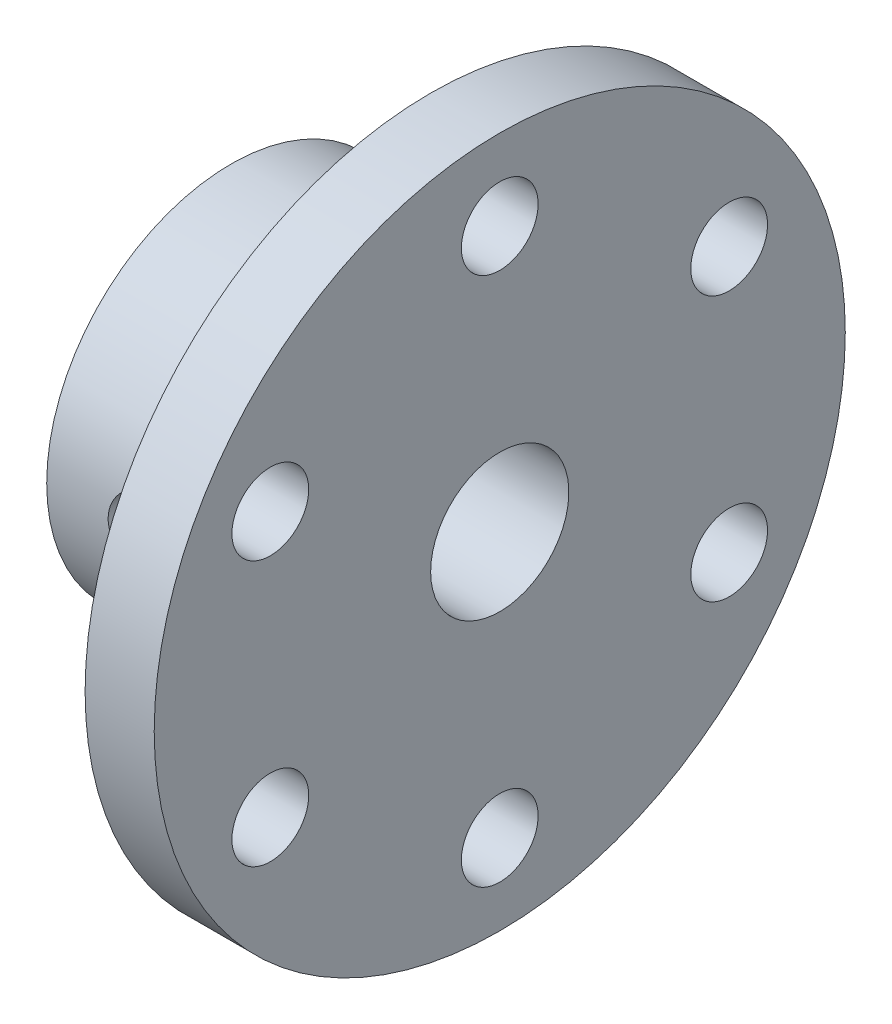
ISO-10303-21;
HEADER;
FILE_DESCRIPTION(('STEP AP214'),'2;1');
FILE_NAME('part.step','',(''),(''),'','','');
FILE_SCHEMA(('AUTOMOTIVE_DESIGN { 1 0 10303 214 1 1 1 1 }'));
ENDSEC;
DATA;
#1=APPLICATION_CONTEXT('core data for automotive mechanical design processes');
#2=APPLICATION_PROTOCOL_DEFINITION('international standard','automotive_design',2000,#1);
#3=PRODUCT_CONTEXT('',#1,'mechanical');
#4=PRODUCT('Part','Part','',(#3));
#5=PRODUCT_RELATED_PRODUCT_CATEGORY('part','',(#4));
#6=PRODUCT_DEFINITION_FORMATION('','',#4);
#7=PRODUCT_DEFINITION_CONTEXT('part definition',#1,'design');
#8=PRODUCT_DEFINITION('design','',#6,#7);
#9=PRODUCT_DEFINITION_SHAPE('','',#8);
#10=(LENGTH_UNIT() NAMED_UNIT(*) SI_UNIT(.MILLI.,.METRE.));
#11=(NAMED_UNIT(*) PLANE_ANGLE_UNIT() SI_UNIT($,.RADIAN.));
#12=(NAMED_UNIT(*) SI_UNIT($,.STERADIAN.) SOLID_ANGLE_UNIT());
#13=UNCERTAINTY_MEASURE_WITH_UNIT(LENGTH_MEASURE(1.E-05),#10,'distance_accuracy_value','');
#14=(GEOMETRIC_REPRESENTATION_CONTEXT(3) GLOBAL_UNCERTAINTY_ASSIGNED_CONTEXT((#13)) GLOBAL_UNIT_ASSIGNED_CONTEXT((#10,
#11,#12)) REPRESENTATION_CONTEXT('',''));
#15=CARTESIAN_POINT('',(0.,0.,0.));
#16=DIRECTION('',(0.,0.,1.));
#17=DIRECTION('',(1.,0.,0.));
#18=AXIS2_PLACEMENT_3D('',#15,#16,#17);
#19=CARTESIAN_POINT('',(-11.6129032258065,0.,0.));
#20=DIRECTION('',(-1.,0.,0.));
#21=DIRECTION('',(0.,0.,1.));
#22=AXIS2_PLACEMENT_3D('',#19,#20,#21);
#23=CYLINDRICAL_SURFACE('',#22,12.);
#24=CARTESIAN_POINT('',(-5.7004608294931,0.,12.));
#25=CARTESIAN_POINT('',(-5.70046578443154,-0.138818083403321,11.999997430533));
#26=CARTESIAN_POINT('',(-5.71206216093059,-0.277697579041751,11.9975665755009));
#27=CARTESIAN_POINT('',(-5.7580995285588,-0.551522632533987,11.9881040198136));
#28=CARTESIAN_POINT('',(-5.79255787556696,-0.686465120256625,11.981068823785));
#29=CARTESIAN_POINT('',(-5.88320173933673,-0.948418264582684,11.963182183924));
#30=CARTESIAN_POINT('',(-5.93936562149087,-1.07543667341837,11.9523345410529));
#31=CARTESIAN_POINT('',(-6.07176004720546,-1.31824065721192,11.9279985561972));
#32=CARTESIAN_POINT('',(-6.14798969180476,-1.43402673506865,11.9145103325195));
#33=CARTESIAN_POINT('',(-6.31953350987439,-1.65278064861767,11.886154000493));
#34=CARTESIAN_POINT('',(-6.41508483196326,-1.75556048832537,11.8712701169706));
#35=CARTESIAN_POINT('',(-6.62205014788332,-1.94375555353879,11.841913153849));
#36=CARTESIAN_POINT('',(-6.73346545323763,-2.02916934192198,11.8274401083337));
#37=CARTESIAN_POINT('',(-6.97036476702542,-2.18102063354433,11.8003888519062));
#38=CARTESIAN_POINT('',(-7.09597759849858,-2.24726109361302,11.7878309034966));
#39=CARTESIAN_POINT('',(-7.35685573303861,-2.35762238696127,11.7662568130004));
#40=CARTESIAN_POINT('',(-7.49211999437817,-2.40174560335282,11.7572402893514));
#41=CARTESIAN_POINT('',(-7.76643130432438,-2.46600480267474,11.7439300197224));
#42=CARTESIAN_POINT('',(-7.90539754816263,-2.48647195393597,11.7395711371173));
#43=CARTESIAN_POINT('',(-8.18485451521836,-2.50386715311229,11.7358738143298));
#44=CARTESIAN_POINT('',(-8.32534506722369,-2.50079781789373,11.7365348160196));
#45=CARTESIAN_POINT('',(-8.60142288544345,-2.47147438074394,11.7427434863835));
#46=CARTESIAN_POINT('',(-8.73705278881553,-2.4456021046544,11.748210673598));
#47=CARTESIAN_POINT('',(-9.00200384878296,-2.3720108705989,11.7632887523188));
#48=CARTESIAN_POINT('',(-9.13132468070576,-2.32429078962763,11.7728998568263));
#49=CARTESIAN_POINT('',(-9.38107528632506,-2.20800006427856,11.795263829282));
#50=CARTESIAN_POINT('',(-9.50143342254725,-2.13928005068473,11.8080390757117));
#51=CARTESIAN_POINT('',(-9.72905231802942,-1.98304539854963,11.8352778002144));
#52=CARTESIAN_POINT('',(-9.83631144716505,-1.89552842452517,11.8497414879707));
#53=CARTESIAN_POINT('',(-10.0368887516538,-1.70214984309356,11.8790746185982));
#54=CARTESIAN_POINT('',(-10.1298931672871,-1.59596286682416,11.8939464639895));
#55=CARTESIAN_POINT('',(-10.296821713951,-1.36933457722359,11.92216176286));
#56=CARTESIAN_POINT('',(-10.3707455586899,-1.24889305005153,11.9355051934047));
#57=CARTESIAN_POINT('',(-10.497480992565,-0.996811082470951,11.9591974188563));
#58=CARTESIAN_POINT('',(-10.5502544386273,-0.865150923852994,11.9695407942052));
#59=CARTESIAN_POINT('',(-10.6328442391641,-0.594569241944303,11.9860267642256));
#60=CARTESIAN_POINT('',(-10.6626636159559,-0.455648677190172,11.9921699119211));
#61=CARTESIAN_POINT('',(-10.6980493336289,-0.177183731401664,11.9994855043091));
#62=CARTESIAN_POINT('',(-10.7040447124816,-0.0376961110523507,12.0007458707516));
#63=CARTESIAN_POINT('',(-10.6927709295549,0.240287597515435,11.9983990450555));
#64=CARTESIAN_POINT('',(-10.6755031922899,0.378783745924522,11.9947921509631));
#65=CARTESIAN_POINT('',(-10.618549522554,0.649452734239632,11.9831712995837));
#66=CARTESIAN_POINT('',(-10.5790858587262,0.781674385788418,11.9752010573615));
#67=CARTESIAN_POINT('',(-10.4791051086503,1.03762289332267,11.9557445448479));
#68=CARTESIAN_POINT('',(-10.4185863477611,1.16134907267356,11.9442579948916));
#69=CARTESIAN_POINT('',(-10.277300073018,1.39858861388699,11.9188248298143));
#70=CARTESIAN_POINT('',(-10.196276970355,1.51194643893967,11.9048478762466));
#71=CARTESIAN_POINT('',(-10.0166217033406,1.72361089177305,11.8760513659942));
#72=CARTESIAN_POINT('',(-9.91798747845521,1.82191575582658,11.8612317108502));
#73=CARTESIAN_POINT('',(-9.70394967549369,2.00235729730361,11.8321204906275));
#74=CARTESIAN_POINT('',(-9.58829476558253,2.08419829200409,11.81784178615));
#75=CARTESIAN_POINT('',(-9.34462826106552,2.22729438158487,11.7917120203161));
#76=CARTESIAN_POINT('',(-9.21661718121488,2.28855033355729,11.779860857893));
#77=CARTESIAN_POINT('',(-8.95253843689663,2.38834492887845,11.7600340141608));
#78=CARTESIAN_POINT('',(-8.81651875516142,2.42700619656064,11.7520374556937));
#79=CARTESIAN_POINT('',(-8.53972772850857,2.48088077046815,11.7407836941939));
#80=CARTESIAN_POINT('',(-8.39895706625421,2.49609743088882,11.7375258132073));
#81=CARTESIAN_POINT('',(-8.1196340274938,2.50251852975223,11.7361581461701));
#82=CARTESIAN_POINT('',(-7.98109268904898,2.49419085245451,11.73794804643));
#83=CARTESIAN_POINT('',(-7.70743281165265,2.45479810628064,11.7462489450985));
#84=CARTESIAN_POINT('',(-7.57231423986088,2.42373325564533,11.7527598981925));
#85=CARTESIAN_POINT('',(-7.30966528571177,2.3399643553717,11.7697226489543));
#86=CARTESIAN_POINT('',(-7.18211433651924,2.28732235136843,11.7801631401586));
#87=CARTESIAN_POINT('',(-6.93758327743976,2.16194914599515,11.8038141147748));
#88=CARTESIAN_POINT('',(-6.82060415022684,2.0892160796606,11.8170248553092));
#89=CARTESIAN_POINT('',(-6.5982175753342,1.92414739068482,11.8450315910229));
#90=CARTESIAN_POINT('',(-6.49306258036312,1.83147578083645,11.8598522773681));
#91=CARTESIAN_POINT('',(-6.29964184304038,1.62984887623067,11.8892367916643));
#92=CARTESIAN_POINT('',(-6.21137999439012,1.52088983766594,11.9038005596976));
#93=CARTESIAN_POINT('',(-6.05328368312497,1.28826885501541,11.9312288909527));
#94=CARTESIAN_POINT('',(-5.98367346972052,1.1644518430427,11.9440719214649));
#95=CARTESIAN_POINT('',(-5.86636037263305,0.906639687996908,11.9663981698818));
#96=CARTESIAN_POINT('',(-5.81863833512934,0.772653563814488,11.975884323642));
#97=CARTESIAN_POINT('',(-5.75538027291624,0.532030585800211,11.9886499956289));
#98=CARTESIAN_POINT('',(-5.73482330307538,0.426735187455858,11.9928807132279));
#99=CARTESIAN_POINT('',(-5.70736192093843,0.214305348353073,11.9985566557952));
#100=CARTESIAN_POINT('',(-5.70045700415871,0.107170975697743,12.0000019836917));
#101=CARTESIAN_POINT('',(-5.7004608294931,0.,12.));
#102=B_SPLINE_CURVE_WITH_KNOTS('',3,(#24,#25,#26,#27,#28,#29,#30,#31,#32,#33,#34,#35,#36,#37,
#38,#39,#40,#41,#42,#43,#44,#45,#46,#47,#48,#49,#50,#51,#52,#53,#54,#55,#56,#57,#58,#59,#60,#61,
#62,#63,#64,#65,#66,#67,#68,#69,#70,#71,#72,#73,#74,#75,#76,#77,#78,#79,#80,#81,#82,#83,#84,#85,
#86,#87,#88,#89,#90,#91,#92,#93,#94,#95,#96,#97,#98,#99,#100,#101),.UNSPECIFIED.,.T.,.F.,(4,2,2,
2,2,2,2,2,2,2,2,2,2,2,2,2,2,2,2,2,2,2,2,2,2,2,2,2,2,2,2,2,2,2,2,2,2,2,4),(0.,0.416062090206367,
0.83244039981245,1.24840475765089,1.66435048314598,2.08575052776245,2.50718543103572,
2.93280898357097,3.35838666570981,3.77793150339709,4.19742969534329,4.61003424258119,
5.0226600006056,5.43829184833498,5.85397536736069,6.27779052710932,6.70161204556436,
7.12619448999325,7.55072102091543,7.96756678815351,8.38438703104555,8.79710573265243,
9.20985726781867,9.62803167991474,10.0462550512915,10.4714252765867,10.8965777970262,
11.3194010019005,11.7421637082837,12.1565844658208,12.5710012456272,12.9842346278651,
13.3975063816296,13.8183804966062,14.2393515023474,14.6651772879651,15.0906297292995,
15.4118517695456,15.7330619394678),.UNSPECIFIED.);
#103=CARTESIAN_POINT('',(-5.7004608294931,0.,12.));
#104=VERTEX_POINT('',#103);
#105=EDGE_CURVE('E93',#104,#104,#102,.T.);
#106=ORIENTED_EDGE('',*,*,#105,.T.);
#107=EDGE_LOOP('',(#106));
#108=FACE_BOUND('',#107,.T.);
#109=CARTESIAN_POINT('',(-14.7004608294931,0.,0.));
#110=DIRECTION('',(-1.,0.,0.));
#111=DIRECTION('',(0.,0.,1.));
#112=AXIS2_PLACEMENT_3D('',#109,#110,#111);
#113=CIRCLE('',#112,12.);
#114=CARTESIAN_POINT('',(-14.7004608294931,0.,12.));
#115=VERTEX_POINT('',#114);
#116=EDGE_CURVE('E10',#115,#115,#113,.T.);
#117=ORIENTED_EDGE('',*,*,#116,.F.);
#118=EDGE_LOOP('',(#117));
#119=FACE_BOUND('',#118,.T.);
#120=CARTESIAN_POINT('',(-1.70046082949309,0.,0.));
#121=DIRECTION('',(-1.,0.,0.));
#122=DIRECTION('',(0.,0.,1.));
#123=AXIS2_PLACEMENT_3D('',#120,#121,#122);
#124=CIRCLE('',#123,12.);
#125=CARTESIAN_POINT('',(-1.70046082949309,0.,12.));
#126=VERTEX_POINT('',#125);
#127=EDGE_CURVE('E58',#126,#126,#124,.T.);
#128=ORIENTED_EDGE('',*,*,#127,.T.);
#129=EDGE_LOOP('',(#128));
#130=FACE_BOUND('',#129,.T.);
#131=ADVANCED_FACE('F35',(#108,#119,#130),#23,.T.);
#132=CARTESIAN_POINT('',(-14.7004608294931,4.5,0.));
#133=DIRECTION('',(1.,0.,0.));
#134=DIRECTION('',(0.,0.,-1.));
#135=AXIS2_PLACEMENT_3D('',#132,#133,#134);
#136=PLANE('',#135);
#137=CARTESIAN_POINT('',(-14.7004608294931,0.,0.));
#138=DIRECTION('',(-1.,0.,0.));
#139=DIRECTION('',(0.,0.,1.));
#140=AXIS2_PLACEMENT_3D('',#137,#138,#139);
#141=CIRCLE('',#140,4.5);
#142=CARTESIAN_POINT('',(-14.7004608294931,0.,4.5));
#143=VERTEX_POINT('',#142);
#144=EDGE_CURVE('E42',#143,#143,#141,.T.);
#145=ORIENTED_EDGE('',*,*,#144,.F.);
#146=EDGE_LOOP('',(#145));
#147=FACE_BOUND('',#146,.T.);
#148=ORIENTED_EDGE('',*,*,#116,.T.);
#149=EDGE_LOOP('',(#148));
#150=FACE_BOUND('',#149,.T.);
#151=ADVANCED_FACE('F154',(#147,#150),#136,.F.);
#152=CARTESIAN_POINT('',(-11.6129032258065,0.,0.));
#153=DIRECTION('',(-1.,0.,0.));
#154=DIRECTION('',(0.,0.,1.));
#155=AXIS2_PLACEMENT_3D('',#152,#153,#154);
#156=CYLINDRICAL_SURFACE('',#155,4.5);
#157=CARTESIAN_POINT('',(-5.7004608294931,0.,4.5));
#158=CARTESIAN_POINT('',(-5.7004571643019,-0.129758090207667,4.50000314465333));
#159=CARTESIAN_POINT('',(-5.71060739985001,-0.259495048046451,4.49433969900333));
#160=CARTESIAN_POINT('',(-5.75065269096491,-0.514936094239148,4.4722793076248));
#161=CARTESIAN_POINT('',(-5.78055141084955,-0.640639429617415,4.45588036993802));
#162=CARTESIAN_POINT('',(-5.85852098655835,-0.884087336941564,4.41402427059755));
#163=CARTESIAN_POINT('',(-5.90652508361543,-1.0018592959983,4.3886004059786));
#164=CARTESIAN_POINT('',(-6.01889249835716,-1.2274597175802,4.33092577070178));
#165=CARTESIAN_POINT('',(-6.08325974687836,-1.33528578235963,4.29867335996867));
#166=CARTESIAN_POINT('',(-6.23154751199603,-1.54633615143593,4.22753981437698));
#167=CARTESIAN_POINT('',(-6.3165164772319,-1.64871905556101,4.18835368821003));
#168=CARTESIAN_POINT('',(-6.50129349685984,-1.83858802759269,4.10855473455516));
#169=CARTESIAN_POINT('',(-6.6011165142759,-1.9260588811793,4.06794050035681));
#170=CARTESIAN_POINT('',(-6.82477603972435,-2.09257063902238,3.98505246395041));
#171=CARTESIAN_POINT('',(-6.95002093070017,-2.1698588213463,3.94302761192724));
#172=CARTESIAN_POINT('',(-7.21415222076762,-2.30193682615168,3.86741690619417));
#173=CARTESIAN_POINT('',(-7.35301873387804,-2.35675885816851,3.83381899786442));
#174=CARTESIAN_POINT('',(-7.61051805244073,-2.43228219832065,3.78623301761536));
#175=CARTESIAN_POINT('',(-7.72727050808539,-2.45773278234939,3.76960776715246));
#176=CARTESIAN_POINT('',(-7.96419646860895,-2.49167870940791,3.74726165075166));
#177=CARTESIAN_POINT('',(-8.08436648246517,-2.50019076575653,3.74153003626678));
#178=CARTESIAN_POINT('',(-8.32479192466561,-2.49980245234747,3.74178926850116));
#179=CARTESIAN_POINT('',(-8.44504730255001,-2.49088301540577,3.74779295170549));
#180=CARTESIAN_POINT('',(-8.68203876789353,-2.45610447914475,3.77067196518534));
#181=CARTESIAN_POINT('',(-8.79877251526869,-2.43023436481244,3.78755436462961));
#182=CARTESIAN_POINT('',(-9.02589307748626,-2.36277650709342,3.82999424192159));
#183=CARTESIAN_POINT('',(-9.13627847491985,-2.32118526919617,3.85555364837623));
#184=CARTESIAN_POINT('',(-9.34886835334788,-2.2237025684374,3.91258606121716));
#185=CARTESIAN_POINT('',(-9.45106961856553,-2.16780552026577,3.9440613760294));
#186=CARTESIAN_POINT('',(-9.66087412483231,-2.03346434937434,4.01517496523541));
#187=CARTESIAN_POINT('',(-9.76693808291042,-1.95288470610688,4.05532685168251));
#188=CARTESIAN_POINT('',(-9.96499778212611,-1.77596825202837,4.13586693478143));
#189=CARTESIAN_POINT('',(-10.0569823092537,-1.67961900609976,4.17625529347124));
#190=CARTESIAN_POINT('',(-10.2336097797988,-1.46213900169329,4.25757409114108));
#191=CARTESIAN_POINT('',(-10.3165630216147,-1.33948616107143,4.29814437745206));
#192=CARTESIAN_POINT('',(-10.4602713782368,-1.07947802612398,4.37068555059183));
#193=CARTESIAN_POINT('',(-10.5210411051095,-0.942132487120818,4.40266209436034));
#194=CARTESIAN_POINT('',(-10.6139716653457,-0.666748026155545,4.45237093488905));
#195=CARTESIAN_POINT('',(-10.6478555988839,-0.529448884330643,4.4709525095323));
#196=CARTESIAN_POINT('',(-10.6919345347374,-0.250024186967271,4.49522961224014));
#197=CARTESIAN_POINT('',(-10.7021504594838,-0.107903006965403,4.50093652134351));
#198=CARTESIAN_POINT('',(-10.6985276106459,0.159736992061356,4.49892791417126));
#199=CARTESIAN_POINT('',(-10.6872840810337,0.285311755713903,4.49266045059943));
#200=CARTESIAN_POINT('',(-10.6463089721832,0.532461389342114,4.47010960580979));
#201=CARTESIAN_POINT('',(-10.6165767921589,0.65403612920241,4.45382589911582));
#202=CARTESIAN_POINT('',(-10.5400895191064,0.889626042147506,4.41280294973003));
#203=CARTESIAN_POINT('',(-10.4933971810545,1.00366727511817,4.38809489870752));
#204=CARTESIAN_POINT('',(-10.3846346471433,1.22242448859806,4.33225575192423));
#205=CARTESIAN_POINT('',(-10.3225603361765,1.32713796346353,4.30112293773311));
#206=CARTESIAN_POINT('',(-10.1775486376563,1.53587082102379,4.23136184219272));
#207=CARTESIAN_POINT('',(-10.0931200773049,1.63870553707675,4.19229170580865));
#208=CARTESIAN_POINT('',(-9.90936775627641,1.82953913965853,4.1126031721819));
#209=CARTESIAN_POINT('',(-9.81002762706539,1.91752149430534,4.07198311058146));
#210=CARTESIAN_POINT('',(-9.58739918187839,2.08511961470323,3.98896862337331));
#211=CARTESIAN_POINT('',(-9.46270656196853,2.16300015680814,3.94680755532472));
#212=CARTESIAN_POINT('',(-9.19961617111344,2.2963793260761,3.87073262793339));
#213=CARTESIAN_POINT('',(-9.06123813251521,2.3519096094174,3.83680713123626));
#214=CARTESIAN_POINT('',(-8.80424385938245,2.42888889767731,3.78841904471707));
#215=CARTESIAN_POINT('',(-8.68751955715707,2.45502886139893,3.77137372433235));
#216=CARTESIAN_POINT('',(-8.45051419214992,2.49033925721538,3.74815645586868));
#217=CARTESIAN_POINT('',(-8.33023680445226,2.49952663983992,3.74197364688922));
#218=CARTESIAN_POINT('',(-8.08943907236195,2.50043819091779,3.74136462499467));
#219=CARTESIAN_POINT('',(-7.96891861187079,2.49214061904494,3.74695304811208));
#220=CARTESIAN_POINT('',(-7.73129284422345,2.45851643173268,3.7690960964836));
#221=CARTESIAN_POINT('',(-7.61418976772197,2.4331789421246,3.78565772428186));
#222=CARTESIAN_POINT('',(-7.38664196407322,2.36679483205659,3.82750534381749));
#223=CARTESIAN_POINT('',(-7.2761782761429,2.32579567267027,3.85276495463757));
#224=CARTESIAN_POINT('',(-7.06335254597256,2.22949442021241,3.90927937487658));
#225=CARTESIAN_POINT('',(-6.96099364447256,2.17418681746633,3.94053649252252));
#226=CARTESIAN_POINT('',(-6.75089853691695,2.04119262548492,4.01123588994594));
#227=CARTESIAN_POINT('',(-6.64467641649667,1.96138962505478,4.05120181770525));
#228=CARTESIAN_POINT('',(-6.44616571145814,1.7860593103316,4.13150106760693));
#229=CARTESIAN_POINT('',(-6.35388849898611,1.6905192936934,4.17183466146657));
#230=CARTESIAN_POINT('',(-6.17624818162492,1.47447866246712,4.25330121765014));
#231=CARTESIAN_POINT('',(-6.09260518370709,1.35241492924804,4.29408020269288));
#232=CARTESIAN_POINT('',(-5.94740576468531,1.09349141366307,4.36718657718672));
#233=CARTESIAN_POINT('',(-5.88583323030352,0.956642521083981,4.3995201278104));
#234=CARTESIAN_POINT('',(-5.79218939148772,0.684823227607052,4.44953408218067));
#235=CARTESIAN_POINT('',(-5.75795818135547,0.550796610514851,4.46827306143731));
#236=CARTESIAN_POINT('',(-5.71210471808862,0.277835968952621,4.49349953832038));
#237=CARTESIAN_POINT('',(-5.70046475307577,0.138905875971108,4.49999663365248));
#238=CARTESIAN_POINT('',(-5.7004608294931,0.,4.5));
#239=B_SPLINE_CURVE_WITH_KNOTS('',3,(#157,#158,#159,#160,#161,#162,#163,#164,#165,#166,#167,
#168,#169,#170,#171,#172,#173,#174,#175,#176,#177,#178,#179,#180,#181,#182,#183,#184,#185,#186,
#187,#188,#189,#190,#191,#192,#193,#194,#195,#196,#197,#198,#199,#200,#201,#202,#203,#204,#205,
#206,#207,#208,#209,#210,#211,#212,#213,#214,#215,#216,#217,#218,#219,#220,#221,#222,#223,#224,
#225,#226,#227,#228,#229,#230,#231,#232,#233,#234,#235,#236,#237,#238),.UNSPECIFIED.,.T.,.F.,(4,
2,2,2,2,2,2,2,2,2,2,2,2,2,2,2,2,2,2,2,2,2,2,2,2,2,2,2,2,2,2,2,2,2,2,2,2,2,2,2,4),(0.,
0.388735550907335,0.777543251702007,1.16493112478047,1.55241214615887,1.96683794951781,
2.38168408101693,2.83857267136893,3.29480391312177,3.6551617664921,4.01516387654727,
4.37555999005166,4.73619053136807,5.09690128126581,5.45775307616217,5.87344204444458,
6.2894603975851,6.74765475008831,7.20554674747981,7.63096944961687,8.05601593594985,
8.43288535066555,8.80976701233836,9.18526813217113,9.56086981770374,9.97519675058502,
10.389981864785,10.846544170616,11.3024575214123,11.6633530399673,12.0238875107277,
12.3848705249248,12.7460841223787,13.1062116731933,13.466478103307,13.8810342040651,
14.2959265740115,14.7540149206222,15.2117681400763,15.6282357181934,16.0443766473137),.UNSPECIFIED.);
#240=CARTESIAN_POINT('',(-5.7004608294931,0.,4.5));
#241=VERTEX_POINT('',#240);
#242=EDGE_CURVE('E104',#241,#241,#239,.T.);
#243=ORIENTED_EDGE('',*,*,#242,.F.);
#244=EDGE_LOOP('',(#243));
#245=FACE_BOUND('',#244,.T.);
#246=CARTESIAN_POINT('',(2.79953917050691,0.,0.));
#247=DIRECTION('',(-1.,0.,0.));
#248=DIRECTION('',(0.,0.,1.));
#249=AXIS2_PLACEMENT_3D('',#246,#247,#248);
#250=CIRCLE('',#249,4.5);
#251=CARTESIAN_POINT('',(2.79953917050691,0.,4.5));
#252=VERTEX_POINT('',#251);
#253=EDGE_CURVE('E46',#252,#252,#250,.T.);
#254=ORIENTED_EDGE('',*,*,#253,.F.);
#255=EDGE_LOOP('',(#254));
#256=FACE_BOUND('',#255,.T.);
#257=ORIENTED_EDGE('',*,*,#144,.T.);
#258=EDGE_LOOP('',(#257));
#259=FACE_BOUND('',#258,.T.);
#260=ADVANCED_FACE('F151',(#245,#256,#259),#156,.F.);
#261=CARTESIAN_POINT('',(2.79953917050691,22.5,0.));
#262=DIRECTION('',(-1.,0.,0.));
#263=DIRECTION('',(0.,0.,1.));
#264=AXIS2_PLACEMENT_3D('',#261,#262,#263);
#265=PLANE('',#264);
#266=CARTESIAN_POINT('',(2.79953917050691,17.25,0.));
#267=DIRECTION('',(-1.,0.,0.));
#268=DIRECTION('',(0.,0.,1.));
#269=AXIS2_PLACEMENT_3D('',#266,#267,#268);
#270=CIRCLE('',#269,2.5);
#271=CARTESIAN_POINT('',(2.79953917050691,17.25,2.5));
#272=VERTEX_POINT('',#271);
#273=EDGE_CURVE('E61',#272,#272,#270,.F.);
#274=ORIENTED_EDGE('',*,*,#273,.F.);
#275=EDGE_LOOP('',(#274));
#276=FACE_BOUND('',#275,.T.);
#277=CARTESIAN_POINT('',(2.79953917050691,8.62499999999914,-14.9389382152811));
#278=DIRECTION('',(-1.,0.,0.));
#279=DIRECTION('',(0.,0.,1.));
#280=AXIS2_PLACEMENT_3D('',#277,#278,#279);
#281=CIRCLE('',#280,2.50000000000092);
#282=CARTESIAN_POINT('',(2.79953917050691,8.62499999999914,-12.4389382152802));
#283=VERTEX_POINT('',#282);
#284=EDGE_CURVE('E69',#283,#283,#281,.F.);
#285=ORIENTED_EDGE('',*,*,#284,.F.);
#286=EDGE_LOOP('',(#285));
#287=FACE_BOUND('',#286,.T.);
#288=CARTESIAN_POINT('',(2.79953917050691,-8.62500000000085,-14.9389382152801));
#289=DIRECTION('',(-1.,0.,0.));
#290=DIRECTION('',(0.,0.,1.));
#291=AXIS2_PLACEMENT_3D('',#288,#289,#290);
#292=CIRCLE('',#291,2.50000000000181);
#293=CARTESIAN_POINT('',(2.79953917050691,-8.62500000000085,-12.4389382152783));
#294=VERTEX_POINT('',#293);
#295=EDGE_CURVE('E62',#294,#294,#292,.F.);
#296=ORIENTED_EDGE('',*,*,#295,.F.);
#297=EDGE_LOOP('',(#296));
#298=FACE_BOUND('',#297,.T.);
#299=CARTESIAN_POINT('',(2.79953917050691,-17.25,1.95687291924082E-12));
#300=DIRECTION('',(-1.,0.,0.));
#301=DIRECTION('',(0.,0.,1.));
#302=AXIS2_PLACEMENT_3D('',#299,#300,#301);
#303=CIRCLE('',#302,2.50000000000199);
#304=CARTESIAN_POINT('',(2.79953917050691,-17.25,2.50000000000394));
#305=VERTEX_POINT('',#304);
#306=EDGE_CURVE('E70',#305,#305,#303,.F.);
#307=ORIENTED_EDGE('',*,*,#306,.F.);
#308=EDGE_LOOP('',(#307));
#309=FACE_BOUND('',#308,.T.);
#310=CARTESIAN_POINT('',(2.79953917050691,-8.62499999999915,14.938938215283));
#311=DIRECTION('',(-1.,0.,0.));
#312=DIRECTION('',(0.,0.,1.));
#313=AXIS2_PLACEMENT_3D('',#310,#311,#312);
#314=CIRCLE('',#313,2.50000000000124);
#315=CARTESIAN_POINT('',(2.79953917050691,-8.62499999999915,17.4389382152843));
#316=VERTEX_POINT('',#315);
#317=EDGE_CURVE('E76',#316,#316,#314,.F.);
#318=ORIENTED_EDGE('',*,*,#317,.F.);
#319=EDGE_LOOP('',(#318));
#320=FACE_BOUND('',#319,.T.);
#321=CARTESIAN_POINT('',(2.79953917050691,8.62500000000085,14.9389382152821));
#322=DIRECTION('',(-1.,0.,0.));
#323=DIRECTION('',(0.,0.,1.));
#324=AXIS2_PLACEMENT_3D('',#321,#322,#323);
#325=CIRCLE('',#324,2.50000000000026);
#326=CARTESIAN_POINT('',(2.79953917050691,8.62500000000085,17.4389382152823));
#327=VERTEX_POINT('',#326);
#328=EDGE_CURVE('E82',#327,#327,#325,.F.);
#329=ORIENTED_EDGE('',*,*,#328,.F.);
#330=EDGE_LOOP('',(#329));
#331=FACE_BOUND('',#330,.T.);
#332=CARTESIAN_POINT('',(2.79953917050691,0.,0.));
#333=DIRECTION('',(-1.,0.,0.));
#334=DIRECTION('',(0.,0.,1.));
#335=AXIS2_PLACEMENT_3D('',#332,#333,#334);
#336=CIRCLE('',#335,22.5);
#337=CARTESIAN_POINT('',(2.79953917050691,0.,22.5));
#338=VERTEX_POINT('',#337);
#339=EDGE_CURVE('E50',#338,#338,#336,.T.);
#340=ORIENTED_EDGE('',*,*,#339,.F.);
#341=EDGE_LOOP('',(#340));
#342=FACE_BOUND('',#341,.T.);
#343=ORIENTED_EDGE('',*,*,#253,.T.);
#344=EDGE_LOOP('',(#343));
#345=FACE_BOUND('',#344,.T.);
#346=ADVANCED_FACE('F147',(#276,#287,#298,#309,#320,#331,#342,#345),#265,.F.);
#347=CARTESIAN_POINT('',(-11.6129032258065,0.,0.));
#348=DIRECTION('',(-1.,0.,0.));
#349=DIRECTION('',(0.,0.,1.));
#350=AXIS2_PLACEMENT_3D('',#347,#348,#349);
#351=CYLINDRICAL_SURFACE('',#350,22.5);
#352=CARTESIAN_POINT('',(-1.70046082949309,0.,0.));
#353=DIRECTION('',(-1.,0.,0.));
#354=DIRECTION('',(0.,0.,1.));
#355=AXIS2_PLACEMENT_3D('',#352,#353,#354);
#356=CIRCLE('',#355,22.5);
#357=CARTESIAN_POINT('',(-1.70046082949309,0.,22.5));
#358=VERTEX_POINT('',#357);
#359=EDGE_CURVE('E55',#358,#358,#356,.T.);
#360=ORIENTED_EDGE('',*,*,#359,.F.);
#361=EDGE_LOOP('',(#360));
#362=FACE_BOUND('',#361,.T.);
#363=ORIENTED_EDGE('',*,*,#339,.T.);
#364=EDGE_LOOP('',(#363));
#365=FACE_BOUND('',#364,.T.);
#366=ADVANCED_FACE('F143',(#362,#365),#351,.T.);
#367=CARTESIAN_POINT('',(-1.70046082949309,12.,0.));
#368=DIRECTION('',(1.,0.,0.));
#369=DIRECTION('',(0.,0.,-1.));
#370=AXIS2_PLACEMENT_3D('',#367,#368,#369);
#371=PLANE('',#370);
#372=CARTESIAN_POINT('',(-1.70046082949309,17.25,0.));
#373=DIRECTION('',(-1.,0.,0.));
#374=DIRECTION('',(0.,0.,1.));
#375=AXIS2_PLACEMENT_3D('',#372,#373,#374);
#376=CIRCLE('',#375,2.5);
#377=CARTESIAN_POINT('',(-1.70046082949309,17.25,2.5));
#378=VERTEX_POINT('',#377);
#379=EDGE_CURVE('E85',#378,#378,#376,.T.);
#380=ORIENTED_EDGE('',*,*,#379,.F.);
#381=EDGE_LOOP('',(#380));
#382=FACE_BOUND('',#381,.T.);
#383=CARTESIAN_POINT('',(-1.70046082949309,8.62499999999914,-14.9389382152811));
#384=DIRECTION('',(-1.,0.,0.));
#385=DIRECTION('',(0.,0.,1.));
#386=AXIS2_PLACEMENT_3D('',#383,#384,#385);
#387=CIRCLE('',#386,2.50000000000092);
#388=CARTESIAN_POINT('',(-1.70046082949309,8.62499999999914,-12.4389382152802));
#389=VERTEX_POINT('',#388);
#390=EDGE_CURVE('E90',#389,#389,#387,.T.);
#391=ORIENTED_EDGE('',*,*,#390,.F.);
#392=EDGE_LOOP('',(#391));
#393=FACE_BOUND('',#392,.T.);
#394=CARTESIAN_POINT('',(-1.70046082949309,-8.62500000000085,-14.9389382152801));
#395=DIRECTION('',(-1.,0.,0.));
#396=DIRECTION('',(0.,0.,1.));
#397=AXIS2_PLACEMENT_3D('',#394,#395,#396);
#398=CIRCLE('',#397,2.50000000000181);
#399=CARTESIAN_POINT('',(-1.70046082949309,-8.62500000000085,-12.4389382152783));
#400=VERTEX_POINT('',#399);
#401=EDGE_CURVE('E66',#400,#400,#398,.T.);
#402=ORIENTED_EDGE('',*,*,#401,.F.);
#403=EDGE_LOOP('',(#402));
#404=FACE_BOUND('',#403,.T.);
#405=CARTESIAN_POINT('',(-1.70046082949309,-17.25,1.95687291924082E-12));
#406=DIRECTION('',(-1.,0.,0.));
#407=DIRECTION('',(0.,0.,1.));
#408=AXIS2_PLACEMENT_3D('',#405,#406,#407);
#409=CIRCLE('',#408,2.50000000000199);
#410=CARTESIAN_POINT('',(-1.70046082949309,-17.25,2.50000000000394));
#411=VERTEX_POINT('',#410);
#412=EDGE_CURVE('E65',#411,#411,#409,.T.);
#413=ORIENTED_EDGE('',*,*,#412,.F.);
#414=EDGE_LOOP('',(#413));
#415=FACE_BOUND('',#414,.T.);
#416=CARTESIAN_POINT('',(-1.70046082949309,-8.62499999999915,14.938938215283));
#417=DIRECTION('',(-1.,0.,0.));
#418=DIRECTION('',(0.,0.,1.));
#419=AXIS2_PLACEMENT_3D('',#416,#417,#418);
#420=CIRCLE('',#419,2.50000000000124);
#421=CARTESIAN_POINT('',(-1.70046082949309,-8.62499999999915,17.4389382152843));
#422=VERTEX_POINT('',#421);
#423=EDGE_CURVE('E73',#422,#422,#420,.T.);
#424=ORIENTED_EDGE('',*,*,#423,.F.);
#425=EDGE_LOOP('',(#424));
#426=FACE_BOUND('',#425,.T.);
#427=CARTESIAN_POINT('',(-1.70046082949309,8.62500000000085,14.9389382152821));
#428=DIRECTION('',(-1.,0.,0.));
#429=DIRECTION('',(0.,0.,1.));
#430=AXIS2_PLACEMENT_3D('',#427,#428,#429);
#431=CIRCLE('',#430,2.50000000000026);
#432=CARTESIAN_POINT('',(-1.70046082949309,8.62500000000085,17.4389382152823));
#433=VERTEX_POINT('',#432);
#434=EDGE_CURVE('E79',#433,#433,#431,.T.);
#435=ORIENTED_EDGE('',*,*,#434,.F.);
#436=EDGE_LOOP('',(#435));
#437=FACE_BOUND('',#436,.T.);
#438=ORIENTED_EDGE('',*,*,#127,.F.);
#439=EDGE_LOOP('',(#438));
#440=FACE_BOUND('',#439,.T.);
#441=ORIENTED_EDGE('',*,*,#359,.T.);
#442=EDGE_LOOP('',(#441));
#443=FACE_BOUND('',#442,.T.);
#444=ADVANCED_FACE('F129',(#382,#393,#404,#415,#426,#437,#440,#443),#371,.F.);
#445=CARTESIAN_POINT('',(9.870606982378,8.62500000000085,14.9389382152821));
#446=DIRECTION('',(-1.,0.,0.));
#447=DIRECTION('',(0.,0.,1.));
#448=AXIS2_PLACEMENT_3D('',#445,#446,#447);
#449=CYLINDRICAL_SURFACE('',#448,2.50000000000026);
#450=ORIENTED_EDGE('',*,*,#328,.T.);
#451=EDGE_LOOP('',(#450));
#452=FACE_BOUND('',#451,.T.);
#453=ORIENTED_EDGE('',*,*,#434,.T.);
#454=EDGE_LOOP('',(#453));
#455=FACE_BOUND('',#454,.T.);
#456=ADVANCED_FACE('F125',(#452,#455),#449,.F.);
#457=CARTESIAN_POINT('',(9.870606982378,-8.62499999999915,14.938938215283));
#458=DIRECTION('',(-1.,0.,0.));
#459=DIRECTION('',(0.,0.,1.));
#460=AXIS2_PLACEMENT_3D('',#457,#458,#459);
#461=CYLINDRICAL_SURFACE('',#460,2.50000000000124);
#462=ORIENTED_EDGE('',*,*,#317,.T.);
#463=EDGE_LOOP('',(#462));
#464=FACE_BOUND('',#463,.T.);
#465=ORIENTED_EDGE('',*,*,#423,.T.);
#466=EDGE_LOOP('',(#465));
#467=FACE_BOUND('',#466,.T.);
#468=ADVANCED_FACE('F128',(#464,#467),#461,.F.);
#469=CARTESIAN_POINT('',(9.870606982378,-17.25,1.95687291924082E-12));
#470=DIRECTION('',(-1.,0.,0.));
#471=DIRECTION('',(0.,0.,1.));
#472=AXIS2_PLACEMENT_3D('',#469,#470,#471);
#473=CYLINDRICAL_SURFACE('',#472,2.50000000000199);
#474=ORIENTED_EDGE('',*,*,#306,.T.);
#475=EDGE_LOOP('',(#474));
#476=FACE_BOUND('',#475,.T.);
#477=ORIENTED_EDGE('',*,*,#412,.T.);
#478=EDGE_LOOP('',(#477));
#479=FACE_BOUND('',#478,.T.);
#480=ADVANCED_FACE('F133',(#476,#479),#473,.F.);
#481=CARTESIAN_POINT('',(9.870606982378,-8.62500000000085,-14.9389382152801));
#482=DIRECTION('',(-1.,0.,0.));
#483=DIRECTION('',(0.,0.,1.));
#484=AXIS2_PLACEMENT_3D('',#481,#482,#483);
#485=CYLINDRICAL_SURFACE('',#484,2.50000000000181);
#486=ORIENTED_EDGE('',*,*,#295,.T.);
#487=EDGE_LOOP('',(#486));
#488=FACE_BOUND('',#487,.T.);
#489=ORIENTED_EDGE('',*,*,#401,.T.);
#490=EDGE_LOOP('',(#489));
#491=FACE_BOUND('',#490,.T.);
#492=ADVANCED_FACE('F123',(#488,#491),#485,.F.);
#493=CARTESIAN_POINT('',(9.870606982378,8.62499999999914,-14.9389382152811));
#494=DIRECTION('',(-1.,0.,0.));
#495=DIRECTION('',(0.,0.,1.));
#496=AXIS2_PLACEMENT_3D('',#493,#494,#495);
#497=CYLINDRICAL_SURFACE('',#496,2.50000000000092);
#498=ORIENTED_EDGE('',*,*,#284,.T.);
#499=EDGE_LOOP('',(#498));
#500=FACE_BOUND('',#499,.T.);
#501=ORIENTED_EDGE('',*,*,#390,.T.);
#502=EDGE_LOOP('',(#501));
#503=FACE_BOUND('',#502,.T.);
#504=ADVANCED_FACE('F119',(#500,#503),#497,.F.);
#505=CARTESIAN_POINT('',(9.870606982378,17.25,0.));
#506=DIRECTION('',(-1.,0.,0.));
#507=DIRECTION('',(0.,0.,1.));
#508=AXIS2_PLACEMENT_3D('',#505,#506,#507);
#509=CYLINDRICAL_SURFACE('',#508,2.5);
#510=ORIENTED_EDGE('',*,*,#273,.T.);
#511=EDGE_LOOP('',(#510));
#512=FACE_BOUND('',#511,.T.);
#513=ORIENTED_EDGE('',*,*,#379,.T.);
#514=EDGE_LOOP('',(#513));
#515=FACE_BOUND('',#514,.T.);
#516=ADVANCED_FACE('F113',(#512,#515),#509,.F.);
#517=CARTESIAN_POINT('',(-8.2004608294931,0.,-22.501));
#518=DIRECTION('',(0.,0.,1.));
#519=DIRECTION('',(1.,0.,0.));
#520=AXIS2_PLACEMENT_3D('',#517,#518,#519);
#521=CYLINDRICAL_SURFACE('',#520,2.5);
#522=ORIENTED_EDGE('',*,*,#242,.T.);
#523=EDGE_LOOP('',(#522));
#524=FACE_BOUND('',#523,.T.);
#525=ORIENTED_EDGE('',*,*,#105,.F.);
#526=EDGE_LOOP('',(#525));
#527=FACE_BOUND('',#526,.T.);
#528=ADVANCED_FACE('F109',(#524,#527),#521,.F.);
#529=CLOSED_SHELL('',(#131,#151,#260,#346,#366,#444,#456,#468,#480,#492,#504,#516,#528));
#530=MANIFOLD_SOLID_BREP('B2',#529);
#531=ADVANCED_BREP_SHAPE_REPRESENTATION('',(#18,#530),#14);
#532=SHAPE_DEFINITION_REPRESENTATION(#9,#531);
ENDSEC;
END-ISO-10303-21;
